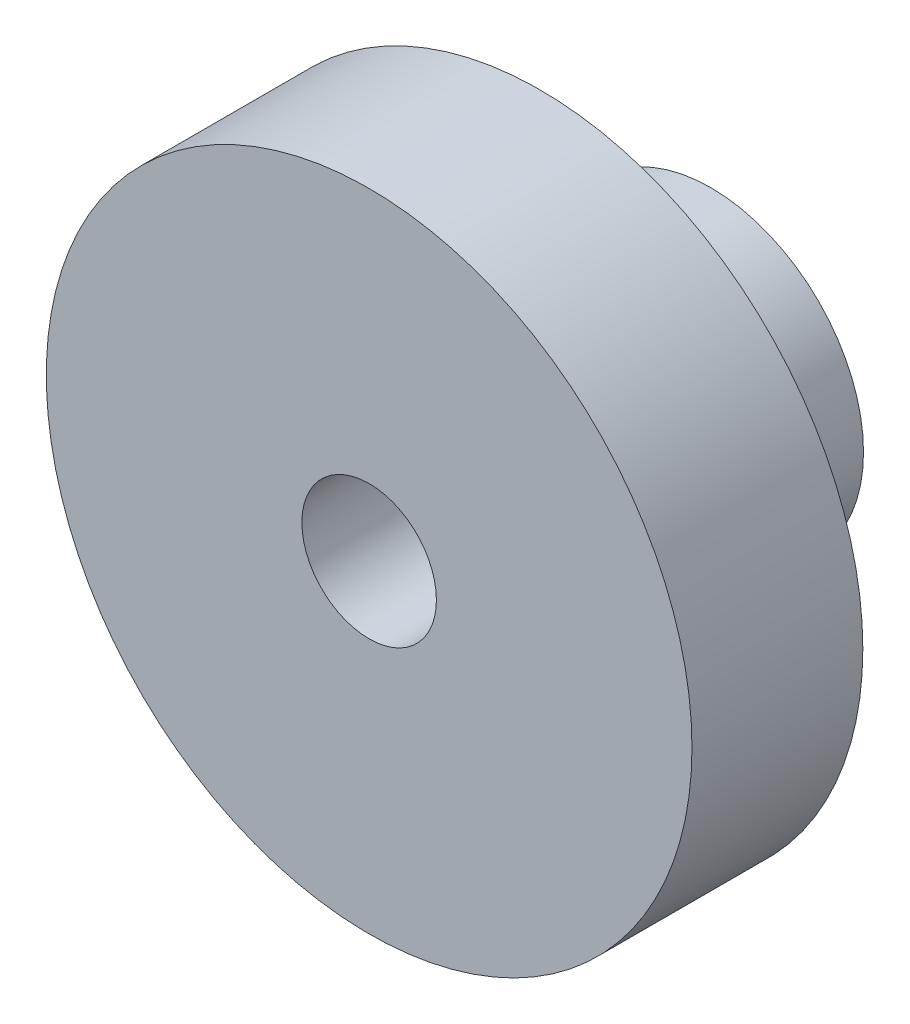
ISO-10303-21;
HEADER;
FILE_DESCRIPTION(('STEP AP214'),'2;1');
FILE_NAME('part.step','',(''),(''),'','','');
FILE_SCHEMA(('AUTOMOTIVE_DESIGN { 1 0 10303 214 1 1 1 1 }'));
ENDSEC;
DATA;
#1=APPLICATION_CONTEXT('core data for automotive mechanical design processes');
#2=APPLICATION_PROTOCOL_DEFINITION('international standard','automotive_design',2000,#1);
#3=PRODUCT_CONTEXT('',#1,'mechanical');
#4=PRODUCT('Part','Part','',(#3));
#5=PRODUCT_RELATED_PRODUCT_CATEGORY('part','',(#4));
#6=PRODUCT_DEFINITION_FORMATION('','',#4);
#7=PRODUCT_DEFINITION_CONTEXT('part definition',#1,'design');
#8=PRODUCT_DEFINITION('design','',#6,#7);
#9=PRODUCT_DEFINITION_SHAPE('','',#8);
#10=(LENGTH_UNIT() NAMED_UNIT(*) SI_UNIT(.MILLI.,.METRE.));
#11=(NAMED_UNIT(*) PLANE_ANGLE_UNIT() SI_UNIT($,.RADIAN.));
#12=(NAMED_UNIT(*) SI_UNIT($,.STERADIAN.) SOLID_ANGLE_UNIT());
#13=UNCERTAINTY_MEASURE_WITH_UNIT(LENGTH_MEASURE(1.E-05),#10,'distance_accuracy_value','');
#14=(GEOMETRIC_REPRESENTATION_CONTEXT(3) GLOBAL_UNCERTAINTY_ASSIGNED_CONTEXT((#13)) GLOBAL_UNIT_ASSIGNED_CONTEXT((#10,
#11,#12)) REPRESENTATION_CONTEXT('',''));
#15=CARTESIAN_POINT('',(0.,0.,0.));
#16=DIRECTION('',(0.,0.,1.));
#17=DIRECTION('',(1.,0.,0.));
#18=AXIS2_PLACEMENT_3D('',#15,#16,#17);
#19=CARTESIAN_POINT('',(0.,0.,6.35));
#20=DIRECTION('',(0.,0.,-1.));
#21=DIRECTION('',(-1.,0.,0.));
#22=AXIS2_PLACEMENT_3D('',#19,#20,#21);
#23=CYLINDRICAL_SURFACE('',#22,2.5);
#24=CARTESIAN_POINT('',(0.,0.,6.35));
#25=DIRECTION('',(0.,0.,1.));
#26=DIRECTION('',(1.,0.,0.));
#27=AXIS2_PLACEMENT_3D('',#24,#25,#26);
#28=CIRCLE('',#27,2.5);
#29=CARTESIAN_POINT('',(2.5,0.,6.35));
#30=VERTEX_POINT('',#29);
#31=EDGE_CURVE('E56',#30,#30,#28,.T.);
#32=ORIENTED_EDGE('',*,*,#31,.T.);
#33=EDGE_LOOP('',(#32));
#34=FACE_BOUND('',#33,.T.);
#35=CARTESIAN_POINT('',(0.,0.,-4.7625));
#36=DIRECTION('',(0.,0.,-1.));
#37=DIRECTION('',(-1.,0.,0.));
#38=AXIS2_PLACEMENT_3D('',#35,#36,#37);
#39=CIRCLE('',#38,2.5);
#40=CARTESIAN_POINT('',(-2.5,0.,-4.7625));
#41=VERTEX_POINT('',#40);
#42=EDGE_CURVE('E65',#41,#41,#39,.T.);
#43=ORIENTED_EDGE('',*,*,#42,.T.);
#44=EDGE_LOOP('',(#43));
#45=FACE_BOUND('',#44,.T.);
#46=ADVANCED_FACE('F37',(#34,#45),#23,.F.);
#47=CARTESIAN_POINT('',(0.,0.,0.));
#48=DIRECTION('',(0.,0.,1.));
#49=DIRECTION('',(1.,0.,0.));
#50=AXIS2_PLACEMENT_3D('',#47,#48,#49);
#51=PLANE('',#50);
#52=CARTESIAN_POINT('',(0.,0.,0.));
#53=DIRECTION('',(0.,0.,1.));
#54=DIRECTION('',(1.,0.,0.));
#55=AXIS2_PLACEMENT_3D('',#52,#53,#54);
#56=CIRCLE('',#55,12.);
#57=CARTESIAN_POINT('',(12.,0.,0.));
#58=VERTEX_POINT('',#57);
#59=EDGE_CURVE('E50',#58,#58,#56,.T.);
#60=ORIENTED_EDGE('',*,*,#59,.F.);
#61=EDGE_LOOP('',(#60));
#62=FACE_BOUND('',#61,.T.);
#63=CARTESIAN_POINT('',(0.,0.,0.));
#64=DIRECTION('',(0.,0.,1.));
#65=DIRECTION('',(1.,0.,0.));
#66=AXIS2_PLACEMENT_3D('',#63,#64,#65);
#67=CIRCLE('',#66,5.675);
#68=CARTESIAN_POINT('',(5.675,0.,0.));
#69=VERTEX_POINT('',#68);
#70=EDGE_CURVE('E10',#69,#69,#67,.F.);
#71=ORIENTED_EDGE('',*,*,#70,.F.);
#72=EDGE_LOOP('',(#71));
#73=FACE_BOUND('',#72,.T.);
#74=ADVANCED_FACE('F101',(#62,#73),#51,.F.);
#75=CARTESIAN_POINT('',(0.,0.,6.35));
#76=DIRECTION('',(0.,0.,1.));
#77=DIRECTION('',(1.,0.,0.));
#78=AXIS2_PLACEMENT_3D('',#75,#76,#77);
#79=PLANE('',#78);
#80=CARTESIAN_POINT('',(0.,0.,6.35));
#81=DIRECTION('',(0.,0.,1.));
#82=DIRECTION('',(1.,0.,0.));
#83=AXIS2_PLACEMENT_3D('',#80,#81,#82);
#84=CIRCLE('',#83,12.);
#85=CARTESIAN_POINT('',(12.,0.,6.35));
#86=VERTEX_POINT('',#85);
#87=EDGE_CURVE('E45',#86,#86,#84,.T.);
#88=ORIENTED_EDGE('',*,*,#87,.T.);
#89=EDGE_LOOP('',(#88));
#90=FACE_BOUND('',#89,.T.);
#91=ORIENTED_EDGE('',*,*,#31,.F.);
#92=EDGE_LOOP('',(#91));
#93=FACE_BOUND('',#92,.T.);
#94=ADVANCED_FACE('F97',(#90,#93),#79,.T.);
#95=CARTESIAN_POINT('',(0.,0.,6.35));
#96=DIRECTION('',(0.,0.,-1.));
#97=DIRECTION('',(-1.,0.,0.));
#98=AXIS2_PLACEMENT_3D('',#95,#96,#97);
#99=CYLINDRICAL_SURFACE('',#98,12.);
#100=ORIENTED_EDGE('',*,*,#87,.F.);
#101=EDGE_LOOP('',(#100));
#102=FACE_BOUND('',#101,.T.);
#103=ORIENTED_EDGE('',*,*,#59,.T.);
#104=EDGE_LOOP('',(#103));
#105=FACE_BOUND('',#104,.T.);
#106=ADVANCED_FACE('F39',(#102,#105),#99,.T.);
#107=CARTESIAN_POINT('',(0.,0.,-6.35));
#108=DIRECTION('',(0.,0.,-1.));
#109=DIRECTION('',(-1.,0.,0.));
#110=AXIS2_PLACEMENT_3D('',#107,#108,#109);
#111=PLANE('',#110);
#112=CARTESIAN_POINT('',(0.,0.,-6.35));
#113=DIRECTION('',(0.,0.,-1.));
#114=DIRECTION('',(-1.,0.,0.));
#115=AXIS2_PLACEMENT_3D('',#112,#113,#114);
#116=CIRCLE('',#115,5.675);
#117=CARTESIAN_POINT('',(-5.675,0.,-6.35));
#118=VERTEX_POINT('',#117);
#119=EDGE_CURVE('E61',#118,#118,#116,.T.);
#120=ORIENTED_EDGE('',*,*,#119,.T.);
#121=EDGE_LOOP('',(#120));
#122=FACE_BOUND('',#121,.T.);
#123=CARTESIAN_POINT('',(0.,0.,-6.35));
#124=DIRECTION('',(0.,0.,-1.));
#125=DIRECTION('',(-1.,0.,0.));
#126=AXIS2_PLACEMENT_3D('',#123,#124,#125);
#127=CIRCLE('',#126,1.5875);
#128=CARTESIAN_POINT('',(-1.5875,0.,-6.35));
#129=VERTEX_POINT('',#128);
#130=EDGE_CURVE('E70',#129,#129,#127,.T.);
#131=ORIENTED_EDGE('',*,*,#130,.F.);
#132=EDGE_LOOP('',(#131));
#133=FACE_BOUND('',#132,.T.);
#134=ADVANCED_FACE('F86',(#122,#133),#111,.T.);
#135=CARTESIAN_POINT('',(0.,0.,-6.35));
#136=DIRECTION('',(0.,0.,1.));
#137=DIRECTION('',(1.,0.,0.));
#138=AXIS2_PLACEMENT_3D('',#135,#136,#137);
#139=CYLINDRICAL_SURFACE('',#138,5.675);
#140=ORIENTED_EDGE('',*,*,#119,.F.);
#141=EDGE_LOOP('',(#140));
#142=FACE_BOUND('',#141,.T.);
#143=ORIENTED_EDGE('',*,*,#70,.T.);
#144=EDGE_LOOP('',(#143));
#145=FACE_BOUND('',#144,.T.);
#146=ADVANCED_FACE('F88',(#142,#145),#139,.T.);
#147=CARTESIAN_POINT('',(0.,0.,-4.7625));
#148=DIRECTION('',(0.,0.,-1.));
#149=DIRECTION('',(-1.,0.,0.));
#150=AXIS2_PLACEMENT_3D('',#147,#148,#149);
#151=PLANE('',#150);
#152=ORIENTED_EDGE('',*,*,#42,.F.);
#153=EDGE_LOOP('',(#152));
#154=FACE_BOUND('',#153,.T.);
#155=CARTESIAN_POINT('',(0.,0.,-4.7625));
#156=DIRECTION('',(0.,0.,-1.));
#157=DIRECTION('',(-1.,0.,0.));
#158=AXIS2_PLACEMENT_3D('',#155,#156,#157);
#159=CIRCLE('',#158,1.5875);
#160=CARTESIAN_POINT('',(-1.5875,0.,-4.7625));
#161=VERTEX_POINT('',#160);
#162=EDGE_CURVE('E69',#161,#161,#159,.T.);
#163=ORIENTED_EDGE('',*,*,#162,.T.);
#164=EDGE_LOOP('',(#163));
#165=FACE_BOUND('',#164,.T.);
#166=ADVANCED_FACE('F78',(#154,#165),#151,.F.);
#167=CARTESIAN_POINT('',(0.,0.,-4.7625));
#168=DIRECTION('',(0.,0.,-1.));
#169=DIRECTION('',(-1.,0.,0.));
#170=AXIS2_PLACEMENT_3D('',#167,#168,#169);
#171=CYLINDRICAL_SURFACE('',#170,1.5875);
#172=ORIENTED_EDGE('',*,*,#162,.F.);
#173=EDGE_LOOP('',(#172));
#174=FACE_BOUND('',#173,.T.);
#175=ORIENTED_EDGE('',*,*,#130,.T.);
#176=EDGE_LOOP('',(#175));
#177=FACE_BOUND('',#176,.T.);
#178=ADVANCED_FACE('F80',(#174,#177),#171,.F.);
#179=CLOSED_SHELL('',(#46,#74,#94,#106,#134,#146,#166,#178));
#180=MANIFOLD_SOLID_BREP('B2',#179);
#181=ADVANCED_BREP_SHAPE_REPRESENTATION('',(#18,#180),#14);
#182=SHAPE_DEFINITION_REPRESENTATION(#9,#181);
ENDSEC;
END-ISO-10303-21;
